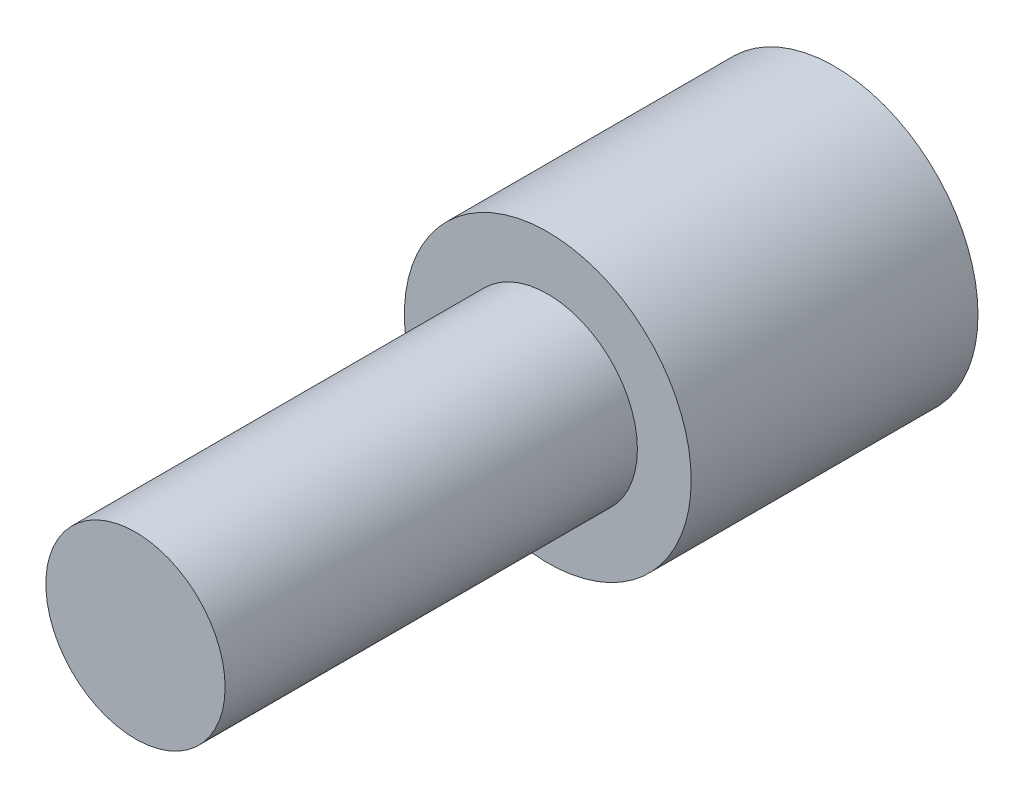
ISO-10303-21;
HEADER;
FILE_DESCRIPTION(('STEP AP214'),'2;1');
FILE_NAME('part.step','',(''),(''),'','','');
FILE_SCHEMA(('AUTOMOTIVE_DESIGN { 1 0 10303 214 1 1 1 1 }'));
ENDSEC;
DATA;
#1=APPLICATION_CONTEXT('core data for automotive mechanical design processes');
#2=APPLICATION_PROTOCOL_DEFINITION('international standard','automotive_design',2000,#1);
#3=PRODUCT_CONTEXT('',#1,'mechanical');
#4=PRODUCT('Part','Part','',(#3));
#5=PRODUCT_RELATED_PRODUCT_CATEGORY('part','',(#4));
#6=PRODUCT_DEFINITION_FORMATION('','',#4);
#7=PRODUCT_DEFINITION_CONTEXT('part definition',#1,'design');
#8=PRODUCT_DEFINITION('design','',#6,#7);
#9=PRODUCT_DEFINITION_SHAPE('','',#8);
#10=(LENGTH_UNIT() NAMED_UNIT(*) SI_UNIT(.MILLI.,.METRE.));
#11=(NAMED_UNIT(*) PLANE_ANGLE_UNIT() SI_UNIT($,.RADIAN.));
#12=(NAMED_UNIT(*) SI_UNIT($,.STERADIAN.) SOLID_ANGLE_UNIT());
#13=UNCERTAINTY_MEASURE_WITH_UNIT(LENGTH_MEASURE(1.E-05),#10,'distance_accuracy_value','');
#14=(GEOMETRIC_REPRESENTATION_CONTEXT(3) GLOBAL_UNCERTAINTY_ASSIGNED_CONTEXT((#13)) GLOBAL_UNIT_ASSIGNED_CONTEXT((#10,
#11,#12)) REPRESENTATION_CONTEXT('',''));
#15=CARTESIAN_POINT('',(0.,0.,0.));
#16=DIRECTION('',(0.,0.,1.));
#17=DIRECTION('',(1.,0.,0.));
#18=AXIS2_PLACEMENT_3D('',#15,#16,#17);
#19=CARTESIAN_POINT('',(0.,0.,40.));
#20=DIRECTION('',(0.,0.,-1.));
#21=DIRECTION('',(-1.,0.,0.));
#22=AXIS2_PLACEMENT_3D('',#19,#20,#21);
#23=CYLINDRICAL_SURFACE('',#22,20.);
#24=CARTESIAN_POINT('',(0.,0.,40.));
#25=DIRECTION('',(0.,0.,1.));
#26=DIRECTION('',(1.,0.,0.));
#27=AXIS2_PLACEMENT_3D('',#24,#25,#26);
#28=CIRCLE('',#27,20.);
#29=CARTESIAN_POINT('',(20.,0.,40.));
#30=VERTEX_POINT('',#29);
#31=EDGE_CURVE('E45',#30,#30,#28,.T.);
#32=ORIENTED_EDGE('',*,*,#31,.F.);
#33=EDGE_LOOP('',(#32));
#34=FACE_BOUND('',#33,.T.);
#35=CARTESIAN_POINT('',(0.,0.,0.));
#36=DIRECTION('',(0.,0.,1.));
#37=DIRECTION('',(1.,0.,0.));
#38=AXIS2_PLACEMENT_3D('',#35,#36,#37);
#39=CIRCLE('',#38,20.);
#40=CARTESIAN_POINT('',(20.,0.,0.));
#41=VERTEX_POINT('',#40);
#42=EDGE_CURVE('E40',#41,#41,#39,.T.);
#43=ORIENTED_EDGE('',*,*,#42,.T.);
#44=EDGE_LOOP('',(#43));
#45=FACE_BOUND('',#44,.T.);
#46=ADVANCED_FACE('F37',(#34,#45),#23,.T.);
#47=CARTESIAN_POINT('',(0.,0.,40.));
#48=DIRECTION('',(0.,0.,1.));
#49=DIRECTION('',(1.,0.,0.));
#50=AXIS2_PLACEMENT_3D('',#47,#48,#49);
#51=PLANE('',#50);
#52=CARTESIAN_POINT('',(0.,0.,40.));
#53=DIRECTION('',(0.,0.,1.));
#54=DIRECTION('',(1.,0.,0.));
#55=AXIS2_PLACEMENT_3D('',#52,#53,#54);
#56=CIRCLE('',#55,12.5);
#57=CARTESIAN_POINT('',(12.5,0.,40.));
#58=VERTEX_POINT('',#57);
#59=EDGE_CURVE('E10',#58,#58,#56,.T.);
#60=ORIENTED_EDGE('',*,*,#59,.F.);
#61=EDGE_LOOP('',(#60));
#62=FACE_BOUND('',#61,.T.);
#63=ORIENTED_EDGE('',*,*,#31,.T.);
#64=EDGE_LOOP('',(#63));
#65=FACE_BOUND('',#64,.T.);
#66=ADVANCED_FACE('F65',(#62,#65),#51,.T.);
#67=CARTESIAN_POINT('',(0.,0.,0.));
#68=DIRECTION('',(0.,0.,1.));
#69=DIRECTION('',(1.,0.,0.));
#70=AXIS2_PLACEMENT_3D('',#67,#68,#69);
#71=PLANE('',#70);
#72=ORIENTED_EDGE('',*,*,#42,.F.);
#73=EDGE_LOOP('',(#72));
#74=FACE_BOUND('',#73,.T.);
#75=ADVANCED_FACE('F62',(#74),#71,.F.);
#76=CARTESIAN_POINT('',(0.,0.,97.5));
#77=DIRECTION('',(0.,0.,-1.));
#78=DIRECTION('',(-1.,0.,0.));
#79=AXIS2_PLACEMENT_3D('',#76,#77,#78);
#80=CYLINDRICAL_SURFACE('',#79,12.5);
#81=CARTESIAN_POINT('',(0.,0.,97.5));
#82=DIRECTION('',(0.,0.,1.));
#83=DIRECTION('',(1.,0.,0.));
#84=AXIS2_PLACEMENT_3D('',#81,#82,#83);
#85=CIRCLE('',#84,12.5);
#86=CARTESIAN_POINT('',(12.5,0.,97.5));
#87=VERTEX_POINT('',#86);
#88=EDGE_CURVE('E52',#87,#87,#85,.T.);
#89=ORIENTED_EDGE('',*,*,#88,.F.);
#90=EDGE_LOOP('',(#89));
#91=FACE_BOUND('',#90,.T.);
#92=ORIENTED_EDGE('',*,*,#59,.T.);
#93=EDGE_LOOP('',(#92));
#94=FACE_BOUND('',#93,.T.);
#95=ADVANCED_FACE('F64',(#91,#94),#80,.T.);
#96=CARTESIAN_POINT('',(0.,0.,97.5));
#97=DIRECTION('',(0.,0.,1.));
#98=DIRECTION('',(1.,0.,0.));
#99=AXIS2_PLACEMENT_3D('',#96,#97,#98);
#100=PLANE('',#99);
#101=ORIENTED_EDGE('',*,*,#88,.T.);
#102=EDGE_LOOP('',(#101));
#103=FACE_BOUND('',#102,.T.);
#104=ADVANCED_FACE('F70',(#103),#100,.T.);
#105=CLOSED_SHELL('',(#46,#66,#75,#95,#104));
#106=MANIFOLD_SOLID_BREP('B2',#105);
#107=ADVANCED_BREP_SHAPE_REPRESENTATION('',(#18,#106),#14);
#108=SHAPE_DEFINITION_REPRESENTATION(#9,#107);
ENDSEC;
END-ISO-10303-21;
